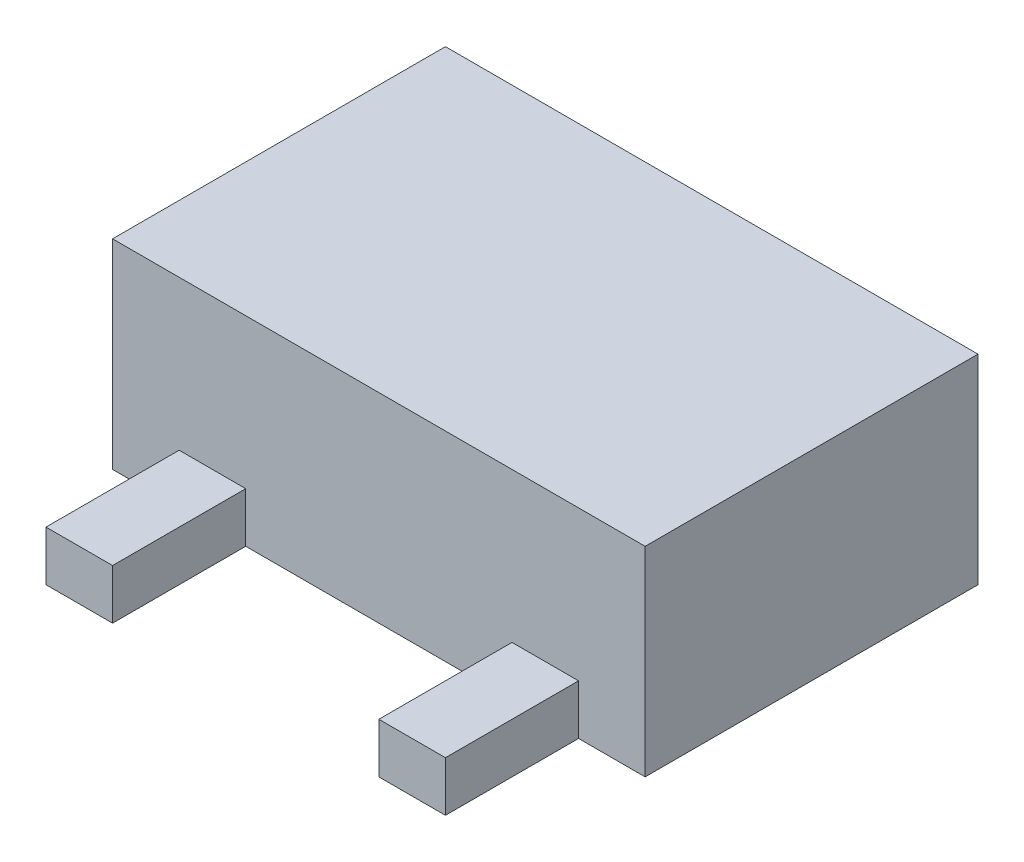
ISO-10303-21;
HEADER;
FILE_DESCRIPTION(('STEP AP214'),'2;1');
FILE_NAME('part.step','',(''),(''),'','','');
FILE_SCHEMA(('AUTOMOTIVE_DESIGN { 1 0 10303 214 1 1 1 1 }'));
ENDSEC;
DATA;
#1=APPLICATION_CONTEXT('core data for automotive mechanical design processes');
#2=APPLICATION_PROTOCOL_DEFINITION('international standard','automotive_design',2000,#1);
#3=PRODUCT_CONTEXT('',#1,'mechanical');
#4=PRODUCT('Part','Part','',(#3));
#5=PRODUCT_RELATED_PRODUCT_CATEGORY('part','',(#4));
#6=PRODUCT_DEFINITION_FORMATION('','',#4);
#7=PRODUCT_DEFINITION_CONTEXT('part definition',#1,'design');
#8=PRODUCT_DEFINITION('design','',#6,#7);
#9=PRODUCT_DEFINITION_SHAPE('','',#8);
#10=(LENGTH_UNIT() NAMED_UNIT(*) SI_UNIT(.MILLI.,.METRE.));
#11=(NAMED_UNIT(*) PLANE_ANGLE_UNIT() SI_UNIT($,.RADIAN.));
#12=(NAMED_UNIT(*) SI_UNIT($,.STERADIAN.) SOLID_ANGLE_UNIT());
#13=UNCERTAINTY_MEASURE_WITH_UNIT(LENGTH_MEASURE(1.E-05),#10,'distance_accuracy_value','');
#14=(GEOMETRIC_REPRESENTATION_CONTEXT(3) GLOBAL_UNCERTAINTY_ASSIGNED_CONTEXT((#13)) GLOBAL_UNIT_ASSIGNED_CONTEXT((#10,
#11,#12)) REPRESENTATION_CONTEXT('',''));
#15=CARTESIAN_POINT('',(0.,0.,0.));
#16=DIRECTION('',(0.,0.,1.));
#17=DIRECTION('',(1.,0.,0.));
#18=AXIS2_PLACEMENT_3D('',#15,#16,#17);
#19=CARTESIAN_POINT('',(-0.8,0.6,0.5));
#20=DIRECTION('',(0.,0.,-1.));
#21=DIRECTION('',(-1.,0.,0.));
#22=AXIS2_PLACEMENT_3D('',#19,#20,#21);
#23=PLANE('',#22);
#24=DIRECTION('',(-1.,0.,0.));
#25=VECTOR('',#24,1.);
#26=CARTESIAN_POINT('',(0.6,0.15,0.5));
#27=LINE('',#26,#25);
#28=CARTESIAN_POINT('',(0.6,0.15,0.5));
#29=VERTEX_POINT('',#28);
#30=CARTESIAN_POINT('',(0.4,0.15,0.5));
#31=VERTEX_POINT('',#30);
#32=EDGE_CURVE('E55',#29,#31,#27,.T.);
#33=ORIENTED_EDGE('',*,*,#32,.F.);
#34=DIRECTION('',(0.,-1.,0.));
#35=VECTOR('',#34,1.);
#36=CARTESIAN_POINT('',(0.6,0.597213595499958,0.5));
#37=LINE('',#36,#35);
#38=CARTESIAN_POINT('',(0.6,0.,0.5));
#39=VERTEX_POINT('',#38);
#40=EDGE_CURVE('E163',#29,#39,#37,.T.);
#41=ORIENTED_EDGE('',*,*,#40,.T.);
#42=DIRECTION('',(1.,0.,0.));
#43=VECTOR('',#42,1.);
#44=CARTESIAN_POINT('',(-0.8,0.,0.5));
#45=LINE('',#44,#43);
#46=CARTESIAN_POINT('',(0.8,0.,0.5));
#47=VERTEX_POINT('',#46);
#48=EDGE_CURVE('E148',#39,#47,#45,.T.);
#49=ORIENTED_EDGE('',*,*,#48,.T.);
#50=DIRECTION('',(0.,-1.,0.));
#51=VECTOR('',#50,1.);
#52=CARTESIAN_POINT('',(0.8,0.6,0.5));
#53=LINE('',#52,#51);
#54=CARTESIAN_POINT('',(0.8,0.6,0.5));
#55=VERTEX_POINT('',#54);
#56=EDGE_CURVE('E250',#55,#47,#53,.T.);
#57=ORIENTED_EDGE('',*,*,#56,.F.);
#58=DIRECTION('',(1.,0.,0.));
#59=VECTOR('',#58,1.);
#60=CARTESIAN_POINT('',(-0.8,0.6,0.5));
#61=LINE('',#60,#59);
#62=CARTESIAN_POINT('',(-0.8,0.6,0.5));
#63=VERTEX_POINT('',#62);
#64=EDGE_CURVE('E248',#63,#55,#61,.T.);
#65=ORIENTED_EDGE('',*,*,#64,.F.);
#66=DIRECTION('',(0.,-1.,0.));
#67=VECTOR('',#66,1.);
#68=CARTESIAN_POINT('',(-0.8,0.6,0.5));
#69=LINE('',#68,#67);
#70=CARTESIAN_POINT('',(-0.8,0.,0.5));
#71=VERTEX_POINT('',#70);
#72=EDGE_CURVE('E259',#63,#71,#69,.T.);
#73=ORIENTED_EDGE('',*,*,#72,.T.);
#74=CARTESIAN_POINT('',(-0.6,0.,0.5));
#75=VERTEX_POINT('',#74);
#76=EDGE_CURVE('E161',#71,#75,#45,.T.);
#77=ORIENTED_EDGE('',*,*,#76,.T.);
#78=DIRECTION('',(0.,-1.,0.));
#79=VECTOR('',#78,1.);
#80=CARTESIAN_POINT('',(-0.6,0.597213595499958,0.5));
#81=LINE('',#80,#79);
#82=CARTESIAN_POINT('',(-0.6,0.15,0.5));
#83=VERTEX_POINT('',#82);
#84=EDGE_CURVE('E206',#83,#75,#81,.T.);
#85=ORIENTED_EDGE('',*,*,#84,.F.);
#86=DIRECTION('',(1.,0.,0.));
#87=VECTOR('',#86,1.);
#88=CARTESIAN_POINT('',(-0.6,0.15,0.5));
#89=LINE('',#88,#87);
#90=CARTESIAN_POINT('',(-0.4,0.15,0.5));
#91=VERTEX_POINT('',#90);
#92=EDGE_CURVE('E192',#83,#91,#89,.T.);
#93=ORIENTED_EDGE('',*,*,#92,.T.);
#94=DIRECTION('',(0.,-1.,0.));
#95=VECTOR('',#94,1.);
#96=CARTESIAN_POINT('',(-0.4,0.597213595499958,0.5));
#97=LINE('',#96,#95);
#98=CARTESIAN_POINT('',(-0.4,0.,0.5));
#99=VERTEX_POINT('',#98);
#100=EDGE_CURVE('E208',#91,#99,#97,.T.);
#101=ORIENTED_EDGE('',*,*,#100,.T.);
#102=CARTESIAN_POINT('',(0.4,0.,0.5));
#103=VERTEX_POINT('',#102);
#104=EDGE_CURVE('E158',#99,#103,#45,.T.);
#105=ORIENTED_EDGE('',*,*,#104,.T.);
#106=DIRECTION('',(0.,-1.,0.));
#107=VECTOR('',#106,1.);
#108=CARTESIAN_POINT('',(0.4,0.597213595499958,0.5));
#109=LINE('',#108,#107);
#110=EDGE_CURVE('E51',#31,#103,#109,.T.);
#111=ORIENTED_EDGE('',*,*,#110,.F.);
#112=EDGE_LOOP('',(#33,#41,#49,#57,#65,#73,#77,#85,#93,#101,#105,#111));
#113=FACE_BOUND('',#112,.T.);
#114=ADVANCED_FACE('F36',(#113),#23,.F.);
#115=CARTESIAN_POINT('',(-0.8,0.6,-0.5));
#116=DIRECTION('',(0.,0.,1.));
#117=DIRECTION('',(1.,0.,0.));
#118=AXIS2_PLACEMENT_3D('',#115,#116,#117);
#119=PLANE('',#118);
#120=DIRECTION('',(0.,-1.,0.));
#121=VECTOR('',#120,1.);
#122=CARTESIAN_POINT('',(0.1,0.15,-0.500000000000001));
#123=LINE('',#122,#121);
#124=CARTESIAN_POINT('',(0.1,0.15,-0.500000000000001));
#125=VERTEX_POINT('',#124);
#126=CARTESIAN_POINT('',(0.1,0.,-0.500000000000001));
#127=VERTEX_POINT('',#126);
#128=EDGE_CURVE('E236',#125,#127,#123,.T.);
#129=ORIENTED_EDGE('',*,*,#128,.F.);
#130=DIRECTION('',(1.,0.,0.));
#131=VECTOR('',#130,1.);
#132=CARTESIAN_POINT('',(-0.1,0.15,-0.500000000000001));
#133=LINE('',#132,#131);
#134=CARTESIAN_POINT('',(-0.1,0.15,-0.500000000000001));
#135=VERTEX_POINT('',#134);
#136=EDGE_CURVE('E219',#135,#125,#133,.T.);
#137=ORIENTED_EDGE('',*,*,#136,.F.);
#138=DIRECTION('',(0.,-1.,0.));
#139=VECTOR('',#138,1.);
#140=CARTESIAN_POINT('',(-0.1,0.15,-0.500000000000001));
#141=LINE('',#140,#139);
#142=CARTESIAN_POINT('',(-0.1,0.,-0.5));
#143=VERTEX_POINT('',#142);
#144=EDGE_CURVE('E238',#135,#143,#141,.T.);
#145=ORIENTED_EDGE('',*,*,#144,.T.);
#146=DIRECTION('',(-1.,0.,0.));
#147=VECTOR('',#146,1.);
#148=CARTESIAN_POINT('',(-0.8,0.,-0.5));
#149=LINE('',#148,#147);
#150=CARTESIAN_POINT('',(-0.8,0.,-0.5));
#151=VERTEX_POINT('',#150);
#152=EDGE_CURVE('E252',#143,#151,#149,.T.);
#153=ORIENTED_EDGE('',*,*,#152,.T.);
#154=DIRECTION('',(0.,-1.,0.));
#155=VECTOR('',#154,1.);
#156=CARTESIAN_POINT('',(-0.8,0.6,-0.5));
#157=LINE('',#156,#155);
#158=CARTESIAN_POINT('',(-0.8,0.6,-0.5));
#159=VERTEX_POINT('',#158);
#160=EDGE_CURVE('E44',#159,#151,#157,.T.);
#161=ORIENTED_EDGE('',*,*,#160,.F.);
#162=DIRECTION('',(-1.,0.,0.));
#163=VECTOR('',#162,1.);
#164=CARTESIAN_POINT('',(-0.8,0.6,-0.5));
#165=LINE('',#164,#163);
#166=CARTESIAN_POINT('',(0.8,0.6,-0.5));
#167=VERTEX_POINT('',#166);
#168=EDGE_CURVE('E244',#167,#159,#165,.T.);
#169=ORIENTED_EDGE('',*,*,#168,.F.);
#170=DIRECTION('',(0.,-1.,0.));
#171=VECTOR('',#170,1.);
#172=CARTESIAN_POINT('',(0.8,0.6,-0.5));
#173=LINE('',#172,#171);
#174=CARTESIAN_POINT('',(0.8,0.,-0.5));
#175=VERTEX_POINT('',#174);
#176=EDGE_CURVE('E11',#167,#175,#173,.T.);
#177=ORIENTED_EDGE('',*,*,#176,.T.);
#178=EDGE_CURVE('E253',#175,#127,#149,.T.);
#179=ORIENTED_EDGE('',*,*,#178,.T.);
#180=EDGE_LOOP('',(#129,#137,#145,#153,#161,#169,#177,#179));
#181=FACE_BOUND('',#180,.T.);
#182=ADVANCED_FACE('F281',(#181),#119,.F.);
#183=CARTESIAN_POINT('',(0.8,0.6,-0.5));
#184=DIRECTION('',(-1.,0.,0.));
#185=DIRECTION('',(0.,0.,1.));
#186=AXIS2_PLACEMENT_3D('',#183,#184,#185);
#187=PLANE('',#186);
#188=DIRECTION('',(0.,0.,-1.));
#189=VECTOR('',#188,1.);
#190=CARTESIAN_POINT('',(0.8,0.,-0.5));
#191=LINE('',#190,#189);
#192=EDGE_CURVE('E155',#47,#175,#191,.T.);
#193=ORIENTED_EDGE('',*,*,#192,.T.);
#194=ORIENTED_EDGE('',*,*,#176,.F.);
#195=DIRECTION('',(0.,0.,-1.));
#196=VECTOR('',#195,1.);
#197=CARTESIAN_POINT('',(0.8,0.6,-0.5));
#198=LINE('',#197,#196);
#199=EDGE_CURVE('E241',#55,#167,#198,.T.);
#200=ORIENTED_EDGE('',*,*,#199,.F.);
#201=ORIENTED_EDGE('',*,*,#56,.T.);
#202=EDGE_LOOP('',(#193,#194,#200,#201));
#203=FACE_BOUND('',#202,.T.);
#204=ADVANCED_FACE('F38',(#203),#187,.F.);
#205=CARTESIAN_POINT('',(-0.8,0.6,-0.5));
#206=DIRECTION('',(1.,0.,0.));
#207=DIRECTION('',(0.,0.,-1.));
#208=AXIS2_PLACEMENT_3D('',#205,#206,#207);
#209=PLANE('',#208);
#210=DIRECTION('',(0.,0.,1.));
#211=VECTOR('',#210,1.);
#212=CARTESIAN_POINT('',(-0.8,0.,-0.5));
#213=LINE('',#212,#211);
#214=EDGE_CURVE('E159',#151,#71,#213,.T.);
#215=ORIENTED_EDGE('',*,*,#214,.T.);
#216=ORIENTED_EDGE('',*,*,#72,.F.);
#217=DIRECTION('',(0.,0.,1.));
#218=VECTOR('',#217,1.);
#219=CARTESIAN_POINT('',(-0.8,0.6,-0.5));
#220=LINE('',#219,#218);
#221=EDGE_CURVE('E246',#159,#63,#220,.T.);
#222=ORIENTED_EDGE('',*,*,#221,.F.);
#223=ORIENTED_EDGE('',*,*,#160,.T.);
#224=EDGE_LOOP('',(#215,#216,#222,#223));
#225=FACE_BOUND('',#224,.T.);
#226=ADVANCED_FACE('F266',(#225),#209,.F.);
#227=CARTESIAN_POINT('',(0.,0.6,0.));
#228=DIRECTION('',(0.,1.,0.));
#229=DIRECTION('',(0.,0.,1.));
#230=AXIS2_PLACEMENT_3D('',#227,#228,#229);
#231=PLANE('',#230);
#232=ORIENTED_EDGE('',*,*,#199,.T.);
#233=ORIENTED_EDGE('',*,*,#168,.T.);
#234=ORIENTED_EDGE('',*,*,#221,.T.);
#235=ORIENTED_EDGE('',*,*,#64,.T.);
#236=EDGE_LOOP('',(#232,#233,#234,#235));
#237=FACE_BOUND('',#236,.T.);
#238=ADVANCED_FACE('F278',(#237),#231,.T.);
#239=CARTESIAN_POINT('',(0.,0.,0.));
#240=DIRECTION('',(0.,1.,0.));
#241=DIRECTION('',(0.,0.,1.));
#242=AXIS2_PLACEMENT_3D('',#239,#240,#241);
#243=PLANE('',#242);
#244=ORIENTED_EDGE('',*,*,#192,.F.);
#245=ORIENTED_EDGE('',*,*,#48,.F.);
#246=DIRECTION('',(0.,0.,1.));
#247=VECTOR('',#246,1.);
#248=CARTESIAN_POINT('',(0.6,0.,0.5));
#249=LINE('',#248,#247);
#250=CARTESIAN_POINT('',(0.6,0.,0.9));
#251=VERTEX_POINT('',#250);
#252=EDGE_CURVE('E152',#39,#251,#249,.T.);
#253=ORIENTED_EDGE('',*,*,#252,.T.);
#254=DIRECTION('',(-1.,0.,0.));
#255=VECTOR('',#254,1.);
#256=CARTESIAN_POINT('',(0.6,0.,0.9));
#257=LINE('',#256,#255);
#258=CARTESIAN_POINT('',(0.4,0.,0.9));
#259=VERTEX_POINT('',#258);
#260=EDGE_CURVE('E174',#251,#259,#257,.T.);
#261=ORIENTED_EDGE('',*,*,#260,.T.);
#262=DIRECTION('',(0.,0.,-1.));
#263=VECTOR('',#262,1.);
#264=CARTESIAN_POINT('',(0.4,0.,0.5));
#265=LINE('',#264,#263);
#266=EDGE_CURVE('E171',#259,#103,#265,.T.);
#267=ORIENTED_EDGE('',*,*,#266,.T.);
#268=ORIENTED_EDGE('',*,*,#104,.F.);
#269=DIRECTION('',(0.,0.,-1.));
#270=VECTOR('',#269,1.);
#271=CARTESIAN_POINT('',(-0.4,0.,0.5));
#272=LINE('',#271,#270);
#273=CARTESIAN_POINT('',(-0.4,0.,0.9));
#274=VERTEX_POINT('',#273);
#275=EDGE_CURVE('E204',#274,#99,#272,.T.);
#276=ORIENTED_EDGE('',*,*,#275,.F.);
#277=DIRECTION('',(1.,0.,0.));
#278=VECTOR('',#277,1.);
#279=CARTESIAN_POINT('',(-0.6,0.,0.9));
#280=LINE('',#279,#278);
#281=CARTESIAN_POINT('',(-0.6,0.,0.9));
#282=VERTEX_POINT('',#281);
#283=EDGE_CURVE('E201',#282,#274,#280,.T.);
#284=ORIENTED_EDGE('',*,*,#283,.F.);
#285=DIRECTION('',(0.,0.,1.));
#286=VECTOR('',#285,1.);
#287=CARTESIAN_POINT('',(-0.6,0.,0.5));
#288=LINE('',#287,#286);
#289=EDGE_CURVE('E187',#75,#282,#288,.T.);
#290=ORIENTED_EDGE('',*,*,#289,.F.);
#291=ORIENTED_EDGE('',*,*,#76,.F.);
#292=ORIENTED_EDGE('',*,*,#214,.F.);
#293=ORIENTED_EDGE('',*,*,#152,.F.);
#294=DIRECTION('',(0.,0.,1.));
#295=VECTOR('',#294,1.);
#296=CARTESIAN_POINT('',(-0.1,0.,-0.500000000000001));
#297=LINE('',#296,#295);
#298=CARTESIAN_POINT('',(-0.1,0.,-0.900000000000001));
#299=VERTEX_POINT('',#298);
#300=EDGE_CURVE('E198',#299,#143,#297,.T.);
#301=ORIENTED_EDGE('',*,*,#300,.F.);
#302=DIRECTION('',(-1.,0.,0.));
#303=VECTOR('',#302,1.);
#304=CARTESIAN_POINT('',(-0.1,0.,-0.900000000000001));
#305=LINE('',#304,#303);
#306=CARTESIAN_POINT('',(0.1,0.,-0.9));
#307=VERTEX_POINT('',#306);
#308=EDGE_CURVE('E220',#307,#299,#305,.T.);
#309=ORIENTED_EDGE('',*,*,#308,.F.);
#310=DIRECTION('',(0.,0.,-1.));
#311=VECTOR('',#310,1.);
#312=CARTESIAN_POINT('',(0.1,0.,-0.500000000000001));
#313=LINE('',#312,#311);
#314=EDGE_CURVE('E228',#127,#307,#313,.T.);
#315=ORIENTED_EDGE('',*,*,#314,.F.);
#316=ORIENTED_EDGE('',*,*,#178,.F.);
#317=EDGE_LOOP('',(#244,#245,#253,#261,#267,#268,#276,#284,#290,#291,#292,#293,#301,#309,#315,#316));
#318=FACE_BOUND('',#317,.T.);
#319=ADVANCED_FACE('F149',(#318),#243,.F.);
#320=CARTESIAN_POINT('',(-0.1,0.15,-0.500000000000001));
#321=DIRECTION('',(1.,0.,0.));
#322=DIRECTION('',(0.,0.,-1.));
#323=AXIS2_PLACEMENT_3D('',#320,#321,#322);
#324=PLANE('',#323);
#325=ORIENTED_EDGE('',*,*,#300,.T.);
#326=ORIENTED_EDGE('',*,*,#144,.F.);
#327=DIRECTION('',(0.,0.,1.));
#328=VECTOR('',#327,1.);
#329=CARTESIAN_POINT('',(-0.1,0.15,-0.500000000000001));
#330=LINE('',#329,#328);
#331=CARTESIAN_POINT('',(-0.1,0.15,-0.900000000000001));
#332=VERTEX_POINT('',#331);
#333=EDGE_CURVE('E217',#332,#135,#330,.T.);
#334=ORIENTED_EDGE('',*,*,#333,.F.);
#335=DIRECTION('',(0.,-1.,0.));
#336=VECTOR('',#335,1.);
#337=CARTESIAN_POINT('',(-0.1,0.15,-0.900000000000001));
#338=LINE('',#337,#336);
#339=EDGE_CURVE('E226',#332,#299,#338,.T.);
#340=ORIENTED_EDGE('',*,*,#339,.T.);
#341=EDGE_LOOP('',(#325,#326,#334,#340));
#342=FACE_BOUND('',#341,.T.);
#343=ADVANCED_FACE('F296',(#342),#324,.F.);
#344=CARTESIAN_POINT('',(0.1,0.15,-0.500000000000001));
#345=DIRECTION('',(-1.,0.,0.));
#346=DIRECTION('',(0.,0.,1.));
#347=AXIS2_PLACEMENT_3D('',#344,#345,#346);
#348=PLANE('',#347);
#349=ORIENTED_EDGE('',*,*,#314,.T.);
#350=DIRECTION('',(0.,-1.,0.));
#351=VECTOR('',#350,1.);
#352=CARTESIAN_POINT('',(0.1,0.15,-0.9));
#353=LINE('',#352,#351);
#354=CARTESIAN_POINT('',(0.1,0.15,-0.9));
#355=VERTEX_POINT('',#354);
#356=EDGE_CURVE('E233',#355,#307,#353,.T.);
#357=ORIENTED_EDGE('',*,*,#356,.F.);
#358=DIRECTION('',(0.,0.,-1.));
#359=VECTOR('',#358,1.);
#360=CARTESIAN_POINT('',(0.1,0.15,-0.500000000000001));
#361=LINE('',#360,#359);
#362=EDGE_CURVE('E222',#125,#355,#361,.T.);
#363=ORIENTED_EDGE('',*,*,#362,.F.);
#364=ORIENTED_EDGE('',*,*,#128,.T.);
#365=EDGE_LOOP('',(#349,#357,#363,#364));
#366=FACE_BOUND('',#365,.T.);
#367=ADVANCED_FACE('F301',(#366),#348,.F.);
#368=CARTESIAN_POINT('',(-0.1,0.15,-0.900000000000001));
#369=DIRECTION('',(0.,0.,1.));
#370=DIRECTION('',(1.,0.,0.));
#371=AXIS2_PLACEMENT_3D('',#368,#369,#370);
#372=PLANE('',#371);
#373=ORIENTED_EDGE('',*,*,#308,.T.);
#374=ORIENTED_EDGE('',*,*,#339,.F.);
#375=DIRECTION('',(-1.,0.,0.));
#376=VECTOR('',#375,1.);
#377=CARTESIAN_POINT('',(-0.1,0.15,-0.900000000000001));
#378=LINE('',#377,#376);
#379=EDGE_CURVE('E224',#355,#332,#378,.T.);
#380=ORIENTED_EDGE('',*,*,#379,.F.);
#381=ORIENTED_EDGE('',*,*,#356,.T.);
#382=EDGE_LOOP('',(#373,#374,#380,#381));
#383=FACE_BOUND('',#382,.T.);
#384=ADVANCED_FACE('F305',(#383),#372,.F.);
#385=CARTESIAN_POINT('',(0.,0.15,0.));
#386=DIRECTION('',(0.,-1.,0.));
#387=DIRECTION('',(0.,0.,-1.));
#388=AXIS2_PLACEMENT_3D('',#385,#386,#387);
#389=PLANE('',#388);
#390=ORIENTED_EDGE('',*,*,#333,.T.);
#391=ORIENTED_EDGE('',*,*,#136,.T.);
#392=ORIENTED_EDGE('',*,*,#362,.T.);
#393=ORIENTED_EDGE('',*,*,#379,.T.);
#394=EDGE_LOOP('',(#390,#391,#392,#393));
#395=FACE_BOUND('',#394,.T.);
#396=ADVANCED_FACE('F309',(#395),#389,.F.);
#397=CARTESIAN_POINT('',(-0.4,0.597213595499958,0.5));
#398=DIRECTION('',(-1.,0.,0.));
#399=DIRECTION('',(0.,0.,1.));
#400=AXIS2_PLACEMENT_3D('',#397,#398,#399);
#401=PLANE('',#400);
#402=ORIENTED_EDGE('',*,*,#100,.F.);
#403=DIRECTION('',(0.,0.,1.));
#404=VECTOR('',#403,1.);
#405=CARTESIAN_POINT('',(-0.4,0.15,0.5));
#406=LINE('',#405,#404);
#407=CARTESIAN_POINT('',(-0.4,0.15,0.9));
#408=VERTEX_POINT('',#407);
#409=EDGE_CURVE('E188',#91,#408,#406,.T.);
#410=ORIENTED_EDGE('',*,*,#409,.T.);
#411=DIRECTION('',(0.,-1.,0.));
#412=VECTOR('',#411,1.);
#413=CARTESIAN_POINT('',(-0.4,0.597213595499958,0.9));
#414=LINE('',#413,#412);
#415=EDGE_CURVE('E211',#408,#274,#414,.T.);
#416=ORIENTED_EDGE('',*,*,#415,.T.);
#417=ORIENTED_EDGE('',*,*,#275,.T.);
#418=EDGE_LOOP('',(#402,#410,#416,#417));
#419=FACE_BOUND('',#418,.T.);
#420=ADVANCED_FACE('F313',(#419),#401,.F.);
#421=CARTESIAN_POINT('',(-0.6,0.597213595499958,0.9));
#422=DIRECTION('',(0.,0.,-1.));
#423=DIRECTION('',(-1.,0.,0.));
#424=AXIS2_PLACEMENT_3D('',#421,#422,#423);
#425=PLANE('',#424);
#426=ORIENTED_EDGE('',*,*,#415,.F.);
#427=DIRECTION('',(-1.,0.,0.));
#428=VECTOR('',#427,1.);
#429=CARTESIAN_POINT('',(-0.6,0.15,0.9));
#430=LINE('',#429,#428);
#431=CARTESIAN_POINT('',(-0.6,0.15,0.9));
#432=VERTEX_POINT('',#431);
#433=EDGE_CURVE('E191',#408,#432,#430,.T.);
#434=ORIENTED_EDGE('',*,*,#433,.T.);
#435=DIRECTION('',(0.,-1.,0.));
#436=VECTOR('',#435,1.);
#437=CARTESIAN_POINT('',(-0.6,0.597213595499958,0.9));
#438=LINE('',#437,#436);
#439=EDGE_CURVE('E213',#432,#282,#438,.T.);
#440=ORIENTED_EDGE('',*,*,#439,.T.);
#441=ORIENTED_EDGE('',*,*,#283,.T.);
#442=EDGE_LOOP('',(#426,#434,#440,#441));
#443=FACE_BOUND('',#442,.T.);
#444=ADVANCED_FACE('F319',(#443),#425,.F.);
#445=CARTESIAN_POINT('',(-0.6,0.597213595499958,0.5));
#446=DIRECTION('',(1.,0.,0.));
#447=DIRECTION('',(0.,0.,-1.));
#448=AXIS2_PLACEMENT_3D('',#445,#446,#447);
#449=PLANE('',#448);
#450=ORIENTED_EDGE('',*,*,#439,.F.);
#451=DIRECTION('',(0.,0.,-1.));
#452=VECTOR('',#451,1.);
#453=CARTESIAN_POINT('',(-0.6,0.15,0.5));
#454=LINE('',#453,#452);
#455=EDGE_CURVE('E195',#432,#83,#454,.T.);
#456=ORIENTED_EDGE('',*,*,#455,.T.);
#457=ORIENTED_EDGE('',*,*,#84,.T.);
#458=ORIENTED_EDGE('',*,*,#289,.T.);
#459=EDGE_LOOP('',(#450,#456,#457,#458));
#460=FACE_BOUND('',#459,.T.);
#461=ADVANCED_FACE('F315',(#460),#449,.F.);
#462=CARTESIAN_POINT('',(0.,0.15,0.));
#463=DIRECTION('',(0.,-1.,0.));
#464=DIRECTION('',(0.,0.,-1.));
#465=AXIS2_PLACEMENT_3D('',#462,#463,#464);
#466=PLANE('',#465);
#467=ORIENTED_EDGE('',*,*,#433,.F.);
#468=ORIENTED_EDGE('',*,*,#409,.F.);
#469=ORIENTED_EDGE('',*,*,#92,.F.);
#470=ORIENTED_EDGE('',*,*,#455,.F.);
#471=EDGE_LOOP('',(#467,#468,#469,#470));
#472=FACE_BOUND('',#471,.T.);
#473=ADVANCED_FACE('F318',(#472),#466,.F.);
#474=CARTESIAN_POINT('',(0.6,0.597213595499958,0.5));
#475=DIRECTION('',(1.,0.,0.));
#476=DIRECTION('',(0.,0.,-1.));
#477=AXIS2_PLACEMENT_3D('',#474,#475,#476);
#478=PLANE('',#477);
#479=DIRECTION('',(0.,0.,-1.));
#480=VECTOR('',#479,1.);
#481=CARTESIAN_POINT('',(0.6,0.15,0.5));
#482=LINE('',#481,#480);
#483=CARTESIAN_POINT('',(0.6,0.15,0.9));
#484=VERTEX_POINT('',#483);
#485=EDGE_CURVE('E177',#484,#29,#482,.T.);
#486=ORIENTED_EDGE('',*,*,#485,.F.);
#487=DIRECTION('',(0.,-1.,0.));
#488=VECTOR('',#487,1.);
#489=CARTESIAN_POINT('',(0.6,0.597213595499958,0.9));
#490=LINE('',#489,#488);
#491=EDGE_CURVE('E170',#484,#251,#490,.T.);
#492=ORIENTED_EDGE('',*,*,#491,.T.);
#493=ORIENTED_EDGE('',*,*,#252,.F.);
#494=ORIENTED_EDGE('',*,*,#40,.F.);
#495=EDGE_LOOP('',(#486,#492,#493,#494));
#496=FACE_BOUND('',#495,.T.);
#497=ADVANCED_FACE('F168',(#496),#478,.T.);
#498=CARTESIAN_POINT('',(0.4,0.597213595499958,0.5));
#499=DIRECTION('',(-1.,0.,0.));
#500=DIRECTION('',(0.,0.,1.));
#501=AXIS2_PLACEMENT_3D('',#498,#499,#500);
#502=PLANE('',#501);
#503=DIRECTION('',(0.,0.,1.));
#504=VECTOR('',#503,1.);
#505=CARTESIAN_POINT('',(0.4,0.15,0.5));
#506=LINE('',#505,#504);
#507=CARTESIAN_POINT('',(0.4,0.15,0.9));
#508=VERTEX_POINT('',#507);
#509=EDGE_CURVE('E166',#31,#508,#506,.T.);
#510=ORIENTED_EDGE('',*,*,#509,.F.);
#511=ORIENTED_EDGE('',*,*,#110,.T.);
#512=ORIENTED_EDGE('',*,*,#266,.F.);
#513=DIRECTION('',(0.,-1.,0.));
#514=VECTOR('',#513,1.);
#515=CARTESIAN_POINT('',(0.4,0.597213595499958,0.9));
#516=LINE('',#515,#514);
#517=EDGE_CURVE('E182',#508,#259,#516,.T.);
#518=ORIENTED_EDGE('',*,*,#517,.F.);
#519=EDGE_LOOP('',(#510,#511,#512,#518));
#520=FACE_BOUND('',#519,.T.);
#521=ADVANCED_FACE('F332',(#520),#502,.T.);
#522=CARTESIAN_POINT('',(0.6,0.597213595499958,0.9));
#523=DIRECTION('',(0.,0.,1.));
#524=DIRECTION('',(1.,0.,0.));
#525=AXIS2_PLACEMENT_3D('',#522,#523,#524);
#526=PLANE('',#525);
#527=DIRECTION('',(1.,0.,0.));
#528=VECTOR('',#527,1.);
#529=CARTESIAN_POINT('',(0.6,0.15,0.9));
#530=LINE('',#529,#528);
#531=EDGE_CURVE('E185',#508,#484,#530,.T.);
#532=ORIENTED_EDGE('',*,*,#531,.F.);
#533=ORIENTED_EDGE('',*,*,#517,.T.);
#534=ORIENTED_EDGE('',*,*,#260,.F.);
#535=ORIENTED_EDGE('',*,*,#491,.F.);
#536=EDGE_LOOP('',(#532,#533,#534,#535));
#537=FACE_BOUND('',#536,.T.);
#538=ADVANCED_FACE('F335',(#537),#526,.T.);
#539=CARTESIAN_POINT('',(0.,0.15,0.));
#540=DIRECTION('',(0.,-1.,0.));
#541=DIRECTION('',(0.,0.,-1.));
#542=AXIS2_PLACEMENT_3D('',#539,#540,#541);
#543=PLANE('',#542);
#544=ORIENTED_EDGE('',*,*,#485,.T.);
#545=ORIENTED_EDGE('',*,*,#32,.T.);
#546=ORIENTED_EDGE('',*,*,#509,.T.);
#547=ORIENTED_EDGE('',*,*,#531,.T.);
#548=EDGE_LOOP('',(#544,#545,#546,#547));
#549=FACE_BOUND('',#548,.T.);
#550=ADVANCED_FACE('F339',(#549),#543,.F.);
#551=CLOSED_SHELL('',(#114,#182,#204,#226,#238,#319,#343,#367,#384,#396,#420,#444,#461,#473,
#497,#521,#538,#550));
#552=MANIFOLD_SOLID_BREP('B2',#551);
#553=ADVANCED_BREP_SHAPE_REPRESENTATION('',(#18,#552),#14);
#554=SHAPE_DEFINITION_REPRESENTATION(#9,#553);
ENDSEC;
END-ISO-10303-21;
